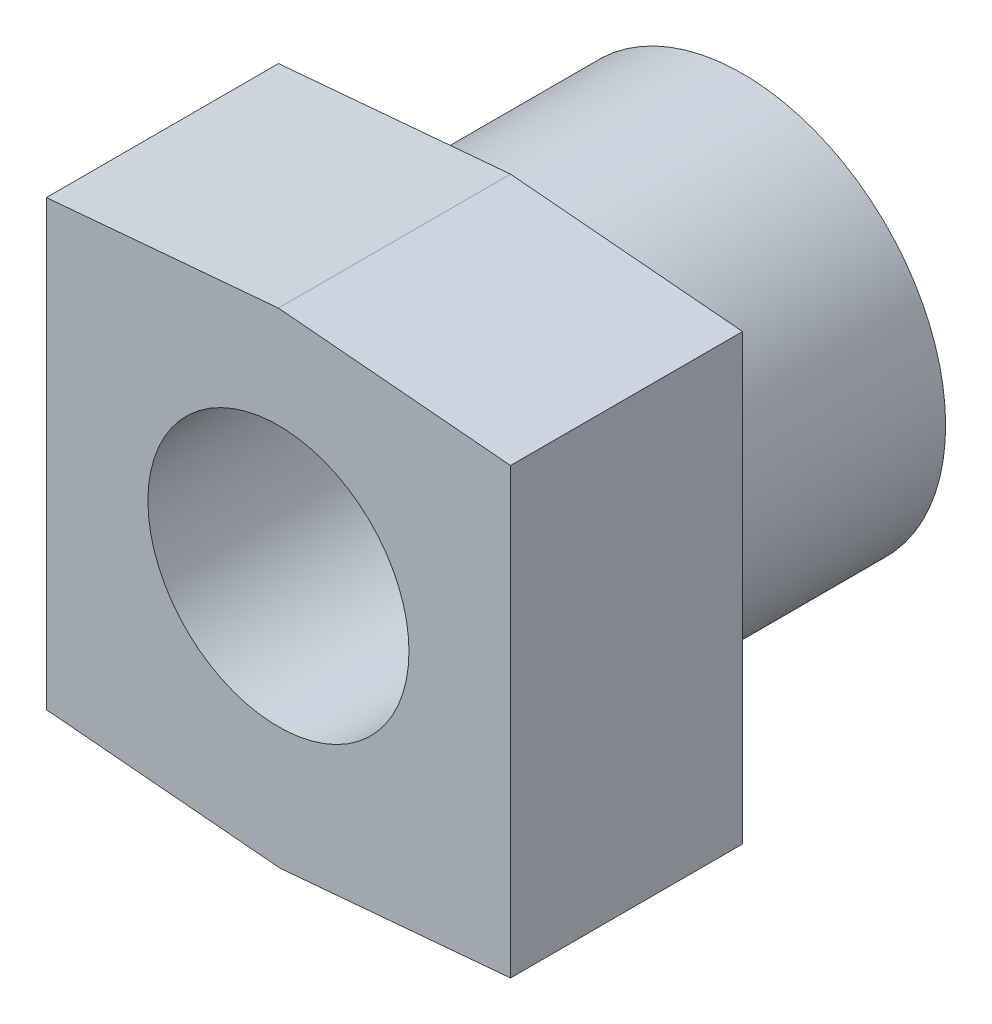
ISO-10303-21;
HEADER;
FILE_DESCRIPTION(('STEP AP214'),'2;1');
FILE_NAME('part.step','',(''),(''),'','','');
FILE_SCHEMA(('AUTOMOTIVE_DESIGN { 1 0 10303 214 1 1 1 1 }'));
ENDSEC;
DATA;
#1=APPLICATION_CONTEXT('core data for automotive mechanical design processes');
#2=APPLICATION_PROTOCOL_DEFINITION('international standard','automotive_design',2000,#1);
#3=PRODUCT_CONTEXT('',#1,'mechanical');
#4=PRODUCT('Part','Part','',(#3));
#5=PRODUCT_RELATED_PRODUCT_CATEGORY('part','',(#4));
#6=PRODUCT_DEFINITION_FORMATION('','',#4);
#7=PRODUCT_DEFINITION_CONTEXT('part definition',#1,'design');
#8=PRODUCT_DEFINITION('design','',#6,#7);
#9=PRODUCT_DEFINITION_SHAPE('','',#8);
#10=(LENGTH_UNIT() NAMED_UNIT(*) SI_UNIT(.MILLI.,.METRE.));
#11=(NAMED_UNIT(*) PLANE_ANGLE_UNIT() SI_UNIT($,.RADIAN.));
#12=(NAMED_UNIT(*) SI_UNIT($,.STERADIAN.) SOLID_ANGLE_UNIT());
#13=UNCERTAINTY_MEASURE_WITH_UNIT(LENGTH_MEASURE(1.E-05),#10,'distance_accuracy_value','');
#14=(GEOMETRIC_REPRESENTATION_CONTEXT(3) GLOBAL_UNCERTAINTY_ASSIGNED_CONTEXT((#13)) GLOBAL_UNIT_ASSIGNED_CONTEXT((#10,
#11,#12)) REPRESENTATION_CONTEXT('',''));
#15=CARTESIAN_POINT('',(0.,0.,0.));
#16=DIRECTION('',(0.,0.,1.));
#17=DIRECTION('',(1.,0.,0.));
#18=AXIS2_PLACEMENT_3D('',#15,#16,#17);
#19=CARTESIAN_POINT('',(0.320815502504319,-43.4744482851928,-40.));
#20=CARTESIAN_POINT('',(0.320815502504319,-43.4744482851928,-26.6666666666667));
#21=CARTESIAN_POINT('',(0.320815502504319,-43.4744482851928,-13.3333333333333));
#22=CARTESIAN_POINT('',(0.320815502504319,-43.4744482851928,0.));
#23=CARTESIAN_POINT('',(-48.0607989879512,-39.2416054941963,-40.));
#24=CARTESIAN_POINT('',(-48.0607989879512,-39.2416054941963,-26.6666666666667));
#25=CARTESIAN_POINT('',(-48.0607989879512,-39.2416054941963,-13.3333333333333));
#26=CARTESIAN_POINT('',(-48.0607989879512,-39.2416054941963,0.));
#27=B_SPLINE_SURFACE_WITH_KNOTS('',1,3,((#19,#20,#21,#22),(#23,#24,#25,#26)),.UNSPECIFIED.,.F.,
.F.,.F.,(2,2),(4,4),(0.,1.),(0.,1.),.UNSPECIFIED.);
#28=CARTESIAN_POINT('',(0.30384493975584,-43.4729635533386,-40.));
#29=CARTESIAN_POINT('',(-6.33745304752246,-42.8919252683542,-40.));
#30=CARTESIAN_POINT('',(-12.9787510348008,-42.3108869833698,-40.));
#31=CARTESIAN_POINT('',(-26.2613470093574,-41.1488104134011,-40.));
#32=CARTESIAN_POINT('',(-32.9026449966357,-40.5677721284167,-40.));
#33=CARTESIAN_POINT('',(-46.1852409711923,-39.4056955584479,-40.));
#34=CARTESIAN_POINT('',(-52.8265389584706,-38.8246572734635,-40.));
#35=CARTESIAN_POINT('',(-59.4678369457489,-38.2436189884791,-40.));
#36=B_SPLINE_CURVE_WITH_KNOTS('',3,(#28,#29,#30,#31,#32,#33,#34,#35),.UNSPECIFIED.,.F.,.F.,(4,2,
2,4),(0.,20.,40.,60.),.UNSPECIFIED.);
#37=CARTESIAN_POINT('',(-40.,-39.9468340246033,-40.));
#38=VERTEX_POINT('',#37);
#39=CARTESIAN_POINT('',(0.30384493975584,-43.4729635533386,-40.));
#40=VERTEX_POINT('',#39);
#41=EDGE_CURVE('E162',#38,#40,#36,.F.);
#42=CARTESIAN_POINT('',(0.303844939755833,-43.4729635533386,-40.));
#43=CARTESIAN_POINT('',(0.303844939755833,-43.4729635533386,-26.6666666666667));
#44=CARTESIAN_POINT('',(0.303844939755833,-43.4729635533386,-13.3333333333333));
#45=CARTESIAN_POINT('',(0.303844939755833,-43.4729635533386,0.));
#46=B_SPLINE_CURVE_WITH_KNOTS('',3,(#42,#43,#44,#45),.UNSPECIFIED.,.F.,.F.,(4,4),(0.,1.),.UNSPECIFIED.);
#47=CARTESIAN_POINT('',(0.30384493975584,-43.4729635533386,0.));
#48=VERTEX_POINT('',#47);
#49=EDGE_CURVE('E13',#40,#48,#46,.T.);
#50=CARTESIAN_POINT('',(-40.,-39.9468340246033,0.));
#51=CARTESIAN_POINT('',(-33.2826925100407,-40.5345222793925,0.));
#52=CARTESIAN_POINT('',(-26.5653850200814,-41.1222105341817,0.));
#53=CARTESIAN_POINT('',(-13.1307700401628,-42.2975870437602,0.));
#54=CARTESIAN_POINT('',(-6.41346255020347,-42.8852752985494,0.));
#55=CARTESIAN_POINT('',(0.303844939755841,-43.4729635533386,0.));
#56=B_SPLINE_CURVE_WITH_KNOTS('',3,(#50,#51,#52,#53,#54,#55),.UNSPECIFIED.,.F.,.F.,(4,2,4),(0.,
20.228899539899,40.457799079798),.UNSPECIFIED.);
#57=CARTESIAN_POINT('',(-40.,-39.9468340246033,0.));
#58=VERTEX_POINT('',#57);
#59=EDGE_CURVE('E111',#58,#48,#56,.T.);
#60=CARTESIAN_POINT('',(-40.,-39.9468340246033,-40.));
#61=CARTESIAN_POINT('',(-40.,-39.9468340246032,-33.3333333333333));
#62=CARTESIAN_POINT('',(-40.,-39.9468340246033,-26.6666666666667));
#63=CARTESIAN_POINT('',(-40.,-39.9468340246033,-16.6666666666667));
#64=CARTESIAN_POINT('',(-40.,-39.9468340246033,-13.3333333333333));
#65=CARTESIAN_POINT('',(-40.,-39.9468340246033,-6.66666666666666));
#66=CARTESIAN_POINT('',(-40.,-39.9468340246033,-3.33333333333334));
#67=CARTESIAN_POINT('',(-40.,-39.9468340246033,0.));
#68=B_SPLINE_CURVE_WITH_KNOTS('',3,(#60,#61,#62,#63,#64,#65,#66,#67),.UNSPECIFIED.,.F.,.F.,(4,2,
2,4),(0.,20.,30.,40.),.UNSPECIFIED.);
#69=EDGE_CURVE('E71',#38,#58,#68,.T.);
#70=ORIENTED_EDGE('',*,*,#41,.T.);
#71=ORIENTED_EDGE('',*,*,#49,.T.);
#72=ORIENTED_EDGE('',*,*,#59,.F.);
#73=ORIENTED_EDGE('',*,*,#69,.F.);
#74=EDGE_LOOP('',(#70,#71,#72,#73));
#75=FACE_BOUND('',#74,.T.);
#76=ADVANCED_FACE('F38',(#75),#27,.F.);
#77=CARTESIAN_POINT('',(39.8477879236698,43.4862297099063,-40.));
#78=DIRECTION('',(-0.0871557427476584,0.996194698091746,0.));
#79=DIRECTION('',(-0.996194698091746,-0.0871557427476584,0.));
#80=AXIS2_PLACEMENT_3D('',#77,#78,#79);
#81=PLANE('',#80);
#82=DIRECTION('',(-0.996194698091746,-0.0871557427476584,0.));
#83=VECTOR('',#82,1.);
#84=CARTESIAN_POINT('',(39.8477879236698,43.4862297099063,0.));
#85=LINE('',#84,#83);
#86=CARTESIAN_POINT('',(0.,40.,0.));
#87=VERTEX_POINT('',#86);
#88=CARTESIAN_POINT('',(-40.,36.500453458963,0.));
#89=VERTEX_POINT('',#88);
#90=EDGE_CURVE('E81',#87,#89,#85,.T.);
#91=ORIENTED_EDGE('',*,*,#90,.F.);
#92=DIRECTION('',(0.,0.,-1.));
#93=VECTOR('',#92,1.);
#94=CARTESIAN_POINT('',(0.,40.,-40.));
#95=LINE('',#94,#93);
#96=CARTESIAN_POINT('',(0.,40.,-40.));
#97=VERTEX_POINT('',#96);
#98=EDGE_CURVE('E50',#87,#97,#95,.T.);
#99=ORIENTED_EDGE('',*,*,#98,.T.);
#100=DIRECTION('',(-0.996194698091746,-0.0871557427476584,0.));
#101=VECTOR('',#100,1.);
#102=CARTESIAN_POINT('',(39.8477879236698,43.4862297099063,-40.));
#103=LINE('',#102,#101);
#104=CARTESIAN_POINT('',(-40.,36.500453458963,-40.));
#105=VERTEX_POINT('',#104);
#106=EDGE_CURVE('E176',#97,#105,#103,.T.);
#107=ORIENTED_EDGE('',*,*,#106,.T.);
#108=DIRECTION('',(0.,0.,1.));
#109=VECTOR('',#108,1.);
#110=CARTESIAN_POINT('',(-40.,36.500453458963,-40.));
#111=LINE('',#110,#109);
#112=EDGE_CURVE('E173',#105,#89,#111,.T.);
#113=ORIENTED_EDGE('',*,*,#112,.T.);
#114=EDGE_LOOP('',(#91,#99,#107,#113));
#115=FACE_BOUND('',#114,.T.);
#116=ADVANCED_FACE('F141',(#115),#81,.T.);
#117=CARTESIAN_POINT('',(0.,0.,-40.));
#118=DIRECTION('',(0.,0.,1.));
#119=DIRECTION('',(1.,0.,0.));
#120=AXIS2_PLACEMENT_3D('',#117,#118,#119);
#121=PLANE('',#120);
#122=DIRECTION('',(0.,-1.,0.));
#123=VECTOR('',#122,1.);
#124=CARTESIAN_POINT('',(-40.,-40.,-40.));
#125=LINE('',#124,#123);
#126=EDGE_CURVE('E107',#105,#38,#125,.T.);
#127=ORIENTED_EDGE('',*,*,#126,.F.);
#128=ORIENTED_EDGE('',*,*,#106,.F.);
#129=DIRECTION('',(-0.996194698091746,0.0871557427476583,0.));
#130=VECTOR('',#129,1.);
#131=CARTESIAN_POINT('',(39.8477879236698,36.5137702900937,-40.));
#132=LINE('',#131,#130);
#133=CARTESIAN_POINT('',(40.,36.500453458963,-40.));
#134=VERTEX_POINT('',#133);
#135=EDGE_CURVE('E109',#134,#97,#132,.T.);
#136=ORIENTED_EDGE('',*,*,#135,.F.);
#137=DIRECTION('',(0.,1.,0.));
#138=VECTOR('',#137,1.);
#139=CARTESIAN_POINT('',(40.,-40.,-40.));
#140=LINE('',#139,#138);
#141=CARTESIAN_POINT('',(40.,-40.,-40.));
#142=VERTEX_POINT('',#141);
#143=EDGE_CURVE('E165',#142,#134,#140,.T.);
#144=ORIENTED_EDGE('',*,*,#143,.F.);
#145=DIRECTION('',(0.996194698091746,0.0871557427476584,0.));
#146=VECTOR('',#145,1.);
#147=CARTESIAN_POINT('',(3.77680849309445,-43.1691186135828,-40.));
#148=LINE('',#147,#146);
#149=EDGE_CURVE('E161',#40,#142,#148,.T.);
#150=ORIENTED_EDGE('',*,*,#149,.F.);
#151=ORIENTED_EDGE('',*,*,#41,.F.);
#152=EDGE_LOOP('',(#127,#128,#136,#144,#150,#151));
#153=FACE_BOUND('',#152,.T.);
#154=CARTESIAN_POINT('',(0.,0.,-40.));
#155=DIRECTION('',(0.,0.,1.));
#156=DIRECTION('',(1.,0.,0.));
#157=AXIS2_PLACEMENT_3D('',#154,#155,#156);
#158=CIRCLE('',#157,35.);
#159=CARTESIAN_POINT('',(35.,0.,-40.));
#160=VERTEX_POINT('',#159);
#161=EDGE_CURVE('E175',#160,#160,#158,.F.);
#162=ORIENTED_EDGE('',*,*,#161,.F.);
#163=EDGE_LOOP('',(#162));
#164=FACE_BOUND('',#163,.T.);
#165=ADVANCED_FACE('F135',(#153,#164),#121,.F.);
#166=CARTESIAN_POINT('',(-40.,-40.,-40.));
#167=DIRECTION('',(-1.,0.,0.));
#168=DIRECTION('',(0.,0.,1.));
#169=AXIS2_PLACEMENT_3D('',#166,#167,#168);
#170=PLANE('',#169);
#171=DIRECTION('',(0.,-1.,0.));
#172=VECTOR('',#171,1.);
#173=CARTESIAN_POINT('',(-40.,-40.,0.));
#174=LINE('',#173,#172);
#175=EDGE_CURVE('E105',#89,#58,#174,.T.);
#176=ORIENTED_EDGE('',*,*,#175,.F.);
#177=ORIENTED_EDGE('',*,*,#112,.F.);
#178=ORIENTED_EDGE('',*,*,#126,.T.);
#179=ORIENTED_EDGE('',*,*,#69,.T.);
#180=EDGE_LOOP('',(#176,#177,#178,#179));
#181=FACE_BOUND('',#180,.T.);
#182=ADVANCED_FACE('F103',(#181),#170,.T.);
#183=CARTESIAN_POINT('',(39.8477879236698,36.5137702900937,-40.));
#184=DIRECTION('',(0.0871557427476583,0.996194698091746,0.));
#185=DIRECTION('',(-0.996194698091746,0.0871557427476583,0.));
#186=AXIS2_PLACEMENT_3D('',#183,#184,#185);
#187=PLANE('',#186);
#188=ORIENTED_EDGE('',*,*,#98,.F.);
#189=DIRECTION('',(-0.996194698091746,0.0871557427476583,0.));
#190=VECTOR('',#189,1.);
#191=CARTESIAN_POINT('',(39.8477879236698,36.5137702900937,0.));
#192=LINE('',#191,#190);
#193=CARTESIAN_POINT('',(40.,36.500453458963,0.));
#194=VERTEX_POINT('',#193);
#195=EDGE_CURVE('E166',#194,#87,#192,.T.);
#196=ORIENTED_EDGE('',*,*,#195,.F.);
#197=DIRECTION('',(0.,0.,1.));
#198=VECTOR('',#197,1.);
#199=CARTESIAN_POINT('',(40.,36.500453458963,-40.));
#200=LINE('',#199,#198);
#201=EDGE_CURVE('E157',#134,#194,#200,.T.);
#202=ORIENTED_EDGE('',*,*,#201,.F.);
#203=ORIENTED_EDGE('',*,*,#135,.T.);
#204=EDGE_LOOP('',(#188,#196,#202,#203));
#205=FACE_BOUND('',#204,.T.);
#206=ADVANCED_FACE('F134',(#205),#187,.T.);
#207=CARTESIAN_POINT('',(40.,-40.,-40.));
#208=DIRECTION('',(1.,0.,0.));
#209=DIRECTION('',(0.,0.,-1.));
#210=AXIS2_PLACEMENT_3D('',#207,#208,#209);
#211=PLANE('',#210);
#212=DIRECTION('',(0.,1.,0.));
#213=VECTOR('',#212,1.);
#214=CARTESIAN_POINT('',(40.,-40.,0.));
#215=LINE('',#214,#213);
#216=CARTESIAN_POINT('',(40.,-40.,0.));
#217=VERTEX_POINT('',#216);
#218=EDGE_CURVE('E112',#217,#194,#215,.T.);
#219=ORIENTED_EDGE('',*,*,#218,.F.);
#220=DIRECTION('',(0.,0.,1.));
#221=VECTOR('',#220,1.);
#222=CARTESIAN_POINT('',(40.,-40.,-40.));
#223=LINE('',#222,#221);
#224=EDGE_CURVE('E108',#142,#217,#223,.T.);
#225=ORIENTED_EDGE('',*,*,#224,.F.);
#226=ORIENTED_EDGE('',*,*,#143,.T.);
#227=ORIENTED_EDGE('',*,*,#201,.T.);
#228=EDGE_LOOP('',(#219,#225,#226,#227));
#229=FACE_BOUND('',#228,.T.);
#230=ADVANCED_FACE('F136',(#229),#211,.T.);
#231=CARTESIAN_POINT('',(40.,-40.,-40.));
#232=DIRECTION('',(0.0871557427476584,-0.996194698091746,0.));
#233=DIRECTION('',(0.996194698091746,0.0871557427476584,0.));
#234=AXIS2_PLACEMENT_3D('',#231,#232,#233);
#235=PLANE('',#234);
#236=ORIENTED_EDGE('',*,*,#49,.F.);
#237=ORIENTED_EDGE('',*,*,#149,.T.);
#238=ORIENTED_EDGE('',*,*,#224,.T.);
#239=DIRECTION('',(0.996194698091746,0.0871557427476584,0.));
#240=VECTOR('',#239,1.);
#241=CARTESIAN_POINT('',(3.77680849309445,-43.1691186135828,0.));
#242=LINE('',#241,#240);
#243=EDGE_CURVE('E98',#48,#217,#242,.T.);
#244=ORIENTED_EDGE('',*,*,#243,.F.);
#245=EDGE_LOOP('',(#236,#237,#238,#244));
#246=FACE_BOUND('',#245,.T.);
#247=ADVANCED_FACE('F144',(#246),#235,.T.);
#248=CARTESIAN_POINT('',(0.,0.,0.));
#249=DIRECTION('',(0.,0.,1.));
#250=DIRECTION('',(1.,0.,0.));
#251=AXIS2_PLACEMENT_3D('',#248,#249,#250);
#252=PLANE('',#251);
#253=CARTESIAN_POINT('',(0.,0.,0.));
#254=DIRECTION('',(0.,0.,1.));
#255=DIRECTION('',(1.,0.,0.));
#256=AXIS2_PLACEMENT_3D('',#253,#254,#255);
#257=CIRCLE('',#256,22.5);
#258=CARTESIAN_POINT('',(22.5,0.,0.));
#259=VERTEX_POINT('',#258);
#260=EDGE_CURVE('E115',#259,#259,#257,.T.);
#261=ORIENTED_EDGE('',*,*,#260,.F.);
#262=EDGE_LOOP('',(#261));
#263=FACE_BOUND('',#262,.T.);
#264=ORIENTED_EDGE('',*,*,#175,.T.);
#265=ORIENTED_EDGE('',*,*,#59,.T.);
#266=ORIENTED_EDGE('',*,*,#243,.T.);
#267=ORIENTED_EDGE('',*,*,#218,.T.);
#268=ORIENTED_EDGE('',*,*,#195,.T.);
#269=ORIENTED_EDGE('',*,*,#90,.T.);
#270=EDGE_LOOP('',(#264,#265,#266,#267,#268,#269));
#271=FACE_BOUND('',#270,.T.);
#272=ADVANCED_FACE('F114',(#263,#271),#252,.T.);
#273=CARTESIAN_POINT('',(0.,0.,-40.));
#274=DIRECTION('',(0.,0.,1.));
#275=DIRECTION('',(1.,0.,0.));
#276=AXIS2_PLACEMENT_3D('',#273,#274,#275);
#277=CYLINDRICAL_SURFACE('',#276,22.5);
#278=ORIENTED_EDGE('',*,*,#260,.T.);
#279=EDGE_LOOP('',(#278));
#280=FACE_BOUND('',#279,.T.);
#281=CARTESIAN_POINT('',(0.,0.,-80.));
#282=DIRECTION('',(0.,0.,-1.));
#283=DIRECTION('',(-1.,0.,0.));
#284=AXIS2_PLACEMENT_3D('',#281,#282,#283);
#285=CIRCLE('',#284,22.5);
#286=CARTESIAN_POINT('',(-22.5,0.,-80.));
#287=VERTEX_POINT('',#286);
#288=EDGE_CURVE('E195',#287,#287,#285,.T.);
#289=ORIENTED_EDGE('',*,*,#288,.T.);
#290=EDGE_LOOP('',(#289));
#291=FACE_BOUND('',#290,.T.);
#292=ADVANCED_FACE('F199',(#280,#291),#277,.F.);
#293=CARTESIAN_POINT('',(0.,0.,-80.));
#294=DIRECTION('',(0.,0.,-1.));
#295=DIRECTION('',(-1.,0.,0.));
#296=AXIS2_PLACEMENT_3D('',#293,#294,#295);
#297=PLANE('',#296);
#298=CARTESIAN_POINT('',(0.,0.,-80.));
#299=DIRECTION('',(0.,0.,-1.));
#300=DIRECTION('',(-1.,0.,0.));
#301=AXIS2_PLACEMENT_3D('',#298,#299,#300);
#302=CIRCLE('',#301,35.);
#303=CARTESIAN_POINT('',(-35.,0.,-80.));
#304=VERTEX_POINT('',#303);
#305=EDGE_CURVE('E119',#304,#304,#302,.T.);
#306=ORIENTED_EDGE('',*,*,#305,.T.);
#307=EDGE_LOOP('',(#306));
#308=FACE_BOUND('',#307,.T.);
#309=ORIENTED_EDGE('',*,*,#288,.F.);
#310=EDGE_LOOP('',(#309));
#311=FACE_BOUND('',#310,.T.);
#312=ADVANCED_FACE('F201',(#308,#311),#297,.T.);
#313=CARTESIAN_POINT('',(0.,0.,-80.));
#314=DIRECTION('',(0.,0.,1.));
#315=DIRECTION('',(1.,0.,0.));
#316=AXIS2_PLACEMENT_3D('',#313,#314,#315);
#317=CYLINDRICAL_SURFACE('',#316,35.);
#318=ORIENTED_EDGE('',*,*,#305,.F.);
#319=EDGE_LOOP('',(#318));
#320=FACE_BOUND('',#319,.T.);
#321=ORIENTED_EDGE('',*,*,#161,.T.);
#322=EDGE_LOOP('',(#321));
#323=FACE_BOUND('',#322,.T.);
#324=ADVANCED_FACE('F203',(#320,#323),#317,.T.);
#325=CLOSED_SHELL('',(#76,#116,#165,#182,#206,#230,#247,#272,#292,#312,#324));
#326=MANIFOLD_SOLID_BREP('B2',#325);
#327=ADVANCED_BREP_SHAPE_REPRESENTATION('',(#18,#326),#14);
#328=SHAPE_DEFINITION_REPRESENTATION(#9,#327);
ENDSEC;
END-ISO-10303-21;
